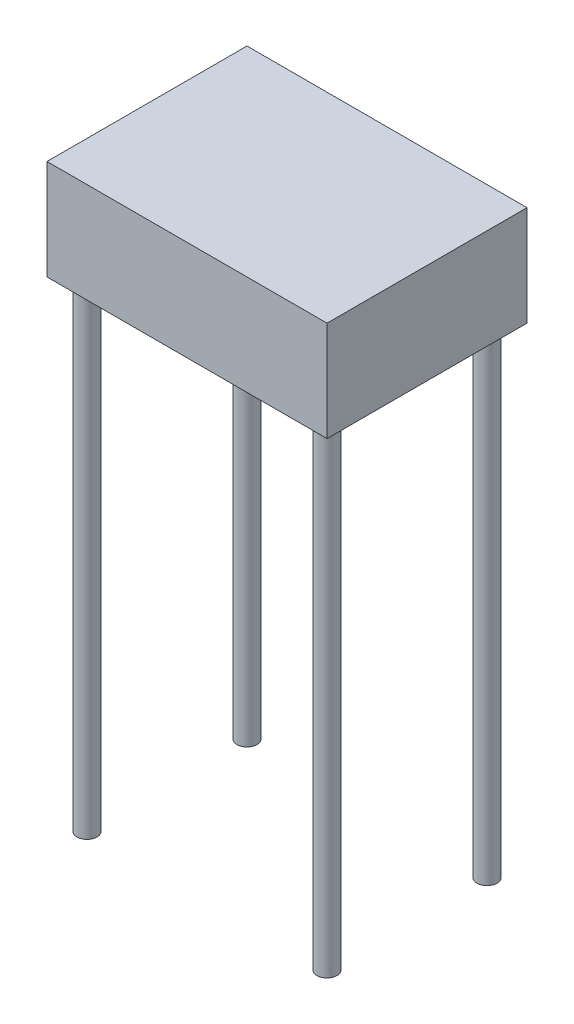
ISO-10303-21;
HEADER;
FILE_DESCRIPTION(('STEP AP214'),'2;1');
FILE_NAME('part.step','',(''),(''),'','','');
FILE_SCHEMA(('AUTOMOTIVE_DESIGN { 1 0 10303 214 1 1 1 1 }'));
ENDSEC;
DATA;
#1=APPLICATION_CONTEXT('core data for automotive mechanical design processes');
#2=APPLICATION_PROTOCOL_DEFINITION('international standard','automotive_design',2000,#1);
#3=PRODUCT_CONTEXT('',#1,'mechanical');
#4=PRODUCT('Part','Part','',(#3));
#5=PRODUCT_RELATED_PRODUCT_CATEGORY('part','',(#4));
#6=PRODUCT_DEFINITION_FORMATION('','',#4);
#7=PRODUCT_DEFINITION_CONTEXT('part definition',#1,'design');
#8=PRODUCT_DEFINITION('design','',#6,#7);
#9=PRODUCT_DEFINITION_SHAPE('','',#8);
#10=(LENGTH_UNIT() NAMED_UNIT(*) SI_UNIT(.MILLI.,.METRE.));
#11=(NAMED_UNIT(*) PLANE_ANGLE_UNIT() SI_UNIT($,.RADIAN.));
#12=(NAMED_UNIT(*) SI_UNIT($,.STERADIAN.) SOLID_ANGLE_UNIT());
#13=UNCERTAINTY_MEASURE_WITH_UNIT(LENGTH_MEASURE(1.E-05),#10,'distance_accuracy_value','');
#14=(GEOMETRIC_REPRESENTATION_CONTEXT(3) GLOBAL_UNCERTAINTY_ASSIGNED_CONTEXT((#13)) GLOBAL_UNIT_ASSIGNED_CONTEXT((#10,
#11,#12)) REPRESENTATION_CONTEXT('',''));
#15=CARTESIAN_POINT('',(0.,0.,0.));
#16=DIRECTION('',(0.,0.,1.));
#17=DIRECTION('',(1.,0.,0.));
#18=AXIS2_PLACEMENT_3D('',#15,#16,#17);
#19=CARTESIAN_POINT('',(-300.,1200.,-200.));
#20=DIRECTION('',(0.,-1.,0.));
#21=DIRECTION('',(0.,0.,-1.));
#22=AXIS2_PLACEMENT_3D('',#19,#20,#21);
#23=CYLINDRICAL_SURFACE('',#22,25.);
#24=CARTESIAN_POINT('',(-300.,1200.,-200.));
#25=DIRECTION('',(0.,1.,0.));
#26=DIRECTION('',(0.,0.,1.));
#27=AXIS2_PLACEMENT_3D('',#24,#25,#26);
#28=CIRCLE('',#27,25.);
#29=CARTESIAN_POINT('',(-300.,1200.,-175.));
#30=VERTEX_POINT('',#29);
#31=EDGE_CURVE('E113',#30,#30,#28,.T.);
#32=ORIENTED_EDGE('',*,*,#31,.F.);
#33=EDGE_LOOP('',(#32));
#34=FACE_BOUND('',#33,.T.);
#35=CARTESIAN_POINT('',(-300.,0.,-200.));
#36=DIRECTION('',(0.,1.,0.));
#37=DIRECTION('',(0.,0.,1.));
#38=AXIS2_PLACEMENT_3D('',#35,#36,#37);
#39=CIRCLE('',#38,25.);
#40=CARTESIAN_POINT('',(-300.,0.,-175.));
#41=VERTEX_POINT('',#40);
#42=EDGE_CURVE('E112',#41,#41,#39,.T.);
#43=ORIENTED_EDGE('',*,*,#42,.T.);
#44=EDGE_LOOP('',(#43));
#45=FACE_BOUND('',#44,.T.);
#46=ADVANCED_FACE('F35',(#34,#45),#23,.T.);
#47=CARTESIAN_POINT('',(-300.,0.,-200.));
#48=DIRECTION('',(0.,1.,0.));
#49=DIRECTION('',(0.,0.,1.));
#50=AXIS2_PLACEMENT_3D('',#47,#48,#49);
#51=PLANE('',#50);
#52=ORIENTED_EDGE('',*,*,#42,.F.);
#53=EDGE_LOOP('',(#52));
#54=FACE_BOUND('',#53,.T.);
#55=ADVANCED_FACE('F149',(#54),#51,.F.);
#56=CARTESIAN_POINT('',(350.,1450.,-250.));
#57=DIRECTION('',(-1.,0.,0.));
#58=DIRECTION('',(0.,0.,1.));
#59=AXIS2_PLACEMENT_3D('',#56,#57,#58);
#60=PLANE('',#59);
#61=DIRECTION('',(0.,0.,-1.));
#62=VECTOR('',#61,1.);
#63=CARTESIAN_POINT('',(350.,1200.,-250.));
#64=LINE('',#63,#62);
#65=CARTESIAN_POINT('',(350.,1200.,250.));
#66=VERTEX_POINT('',#65);
#67=CARTESIAN_POINT('',(350.,1200.,-250.));
#68=VERTEX_POINT('',#67);
#69=EDGE_CURVE('E102',#66,#68,#64,.T.);
#70=ORIENTED_EDGE('',*,*,#69,.T.);
#71=DIRECTION('',(0.,-1.,0.));
#72=VECTOR('',#71,1.);
#73=CARTESIAN_POINT('',(350.,1450.,-250.));
#74=LINE('',#73,#72);
#75=CARTESIAN_POINT('',(350.,1450.,-250.));
#76=VERTEX_POINT('',#75);
#77=EDGE_CURVE('E93',#76,#68,#74,.T.);
#78=ORIENTED_EDGE('',*,*,#77,.F.);
#79=DIRECTION('',(0.,0.,-1.));
#80=VECTOR('',#79,1.);
#81=CARTESIAN_POINT('',(350.,1450.,-250.));
#82=LINE('',#81,#80);
#83=CARTESIAN_POINT('',(350.,1450.,250.));
#84=VERTEX_POINT('',#83);
#85=EDGE_CURVE('E87',#84,#76,#82,.T.);
#86=ORIENTED_EDGE('',*,*,#85,.F.);
#87=DIRECTION('',(0.,-1.,0.));
#88=VECTOR('',#87,1.);
#89=CARTESIAN_POINT('',(350.,1450.,250.));
#90=LINE('',#89,#88);
#91=EDGE_CURVE('E98',#84,#66,#90,.T.);
#92=ORIENTED_EDGE('',*,*,#91,.T.);
#93=EDGE_LOOP('',(#70,#78,#86,#92));
#94=FACE_BOUND('',#93,.T.);
#95=ADVANCED_FACE('F138',(#94),#60,.F.);
#96=CARTESIAN_POINT('',(-350.,1450.,-250.));
#97=DIRECTION('',(0.,0.,1.));
#98=DIRECTION('',(1.,0.,0.));
#99=AXIS2_PLACEMENT_3D('',#96,#97,#98);
#100=PLANE('',#99);
#101=DIRECTION('',(-1.,0.,0.));
#102=VECTOR('',#101,1.);
#103=CARTESIAN_POINT('',(-350.,1200.,-250.));
#104=LINE('',#103,#102);
#105=CARTESIAN_POINT('',(-350.,1200.,-250.));
#106=VERTEX_POINT('',#105);
#107=EDGE_CURVE('E92',#68,#106,#104,.T.);
#108=ORIENTED_EDGE('',*,*,#107,.T.);
#109=DIRECTION('',(0.,-1.,0.));
#110=VECTOR('',#109,1.);
#111=CARTESIAN_POINT('',(-350.,1450.,-250.));
#112=LINE('',#111,#110);
#113=CARTESIAN_POINT('',(-350.,1450.,-250.));
#114=VERTEX_POINT('',#113);
#115=EDGE_CURVE('E90',#114,#106,#112,.T.);
#116=ORIENTED_EDGE('',*,*,#115,.F.);
#117=DIRECTION('',(-1.,0.,0.));
#118=VECTOR('',#117,1.);
#119=CARTESIAN_POINT('',(-350.,1450.,-250.));
#120=LINE('',#119,#118);
#121=EDGE_CURVE('E82',#76,#114,#120,.T.);
#122=ORIENTED_EDGE('',*,*,#121,.F.);
#123=ORIENTED_EDGE('',*,*,#77,.T.);
#124=EDGE_LOOP('',(#108,#116,#122,#123));
#125=FACE_BOUND('',#124,.T.);
#126=ADVANCED_FACE('F91',(#125),#100,.F.);
#127=CARTESIAN_POINT('',(-350.,1450.,-250.));
#128=DIRECTION('',(1.,0.,0.));
#129=DIRECTION('',(0.,0.,-1.));
#130=AXIS2_PLACEMENT_3D('',#127,#128,#129);
#131=PLANE('',#130);
#132=DIRECTION('',(0.,0.,1.));
#133=VECTOR('',#132,1.);
#134=CARTESIAN_POINT('',(-350.,1200.,-250.));
#135=LINE('',#134,#133);
#136=CARTESIAN_POINT('',(-350.,1200.,250.));
#137=VERTEX_POINT('',#136);
#138=EDGE_CURVE('E68',#106,#137,#135,.T.);
#139=ORIENTED_EDGE('',*,*,#138,.T.);
#140=DIRECTION('',(0.,-1.,0.));
#141=VECTOR('',#140,1.);
#142=CARTESIAN_POINT('',(-350.,1450.,250.));
#143=LINE('',#142,#141);
#144=CARTESIAN_POINT('',(-350.,1450.,250.));
#145=VERTEX_POINT('',#144);
#146=EDGE_CURVE('E94',#145,#137,#143,.T.);
#147=ORIENTED_EDGE('',*,*,#146,.F.);
#148=DIRECTION('',(0.,0.,1.));
#149=VECTOR('',#148,1.);
#150=CARTESIAN_POINT('',(-350.,1450.,-250.));
#151=LINE('',#150,#149);
#152=EDGE_CURVE('E85',#114,#145,#151,.T.);
#153=ORIENTED_EDGE('',*,*,#152,.F.);
#154=ORIENTED_EDGE('',*,*,#115,.T.);
#155=EDGE_LOOP('',(#139,#147,#153,#154));
#156=FACE_BOUND('',#155,.T.);
#157=ADVANCED_FACE('F96',(#156),#131,.F.);
#158=CARTESIAN_POINT('',(-350.,1450.,250.));
#159=DIRECTION('',(0.,0.,-1.));
#160=DIRECTION('',(-1.,0.,0.));
#161=AXIS2_PLACEMENT_3D('',#158,#159,#160);
#162=PLANE('',#161);
#163=DIRECTION('',(1.,0.,0.));
#164=VECTOR('',#163,1.);
#165=CARTESIAN_POINT('',(-350.,1200.,250.));
#166=LINE('',#165,#164);
#167=EDGE_CURVE('E74',#137,#66,#166,.T.);
#168=ORIENTED_EDGE('',*,*,#167,.T.);
#169=ORIENTED_EDGE('',*,*,#91,.F.);
#170=DIRECTION('',(1.,0.,0.));
#171=VECTOR('',#170,1.);
#172=CARTESIAN_POINT('',(-350.,1450.,250.));
#173=LINE('',#172,#171);
#174=EDGE_CURVE('E51',#145,#84,#173,.T.);
#175=ORIENTED_EDGE('',*,*,#174,.F.);
#176=ORIENTED_EDGE('',*,*,#146,.T.);
#177=EDGE_LOOP('',(#168,#169,#175,#176));
#178=FACE_BOUND('',#177,.T.);
#179=ADVANCED_FACE('F139',(#178),#162,.F.);
#180=CARTESIAN_POINT('',(0.,1450.,0.));
#181=DIRECTION('',(0.,1.,0.));
#182=DIRECTION('',(0.,0.,1.));
#183=AXIS2_PLACEMENT_3D('',#180,#181,#182);
#184=PLANE('',#183);
#185=ORIENTED_EDGE('',*,*,#85,.T.);
#186=ORIENTED_EDGE('',*,*,#121,.T.);
#187=ORIENTED_EDGE('',*,*,#152,.T.);
#188=ORIENTED_EDGE('',*,*,#174,.T.);
#189=EDGE_LOOP('',(#185,#186,#187,#188));
#190=FACE_BOUND('',#189,.T.);
#191=ADVANCED_FACE('F83',(#190),#184,.T.);
#192=CARTESIAN_POINT('',(0.,1200.,0.));
#193=DIRECTION('',(0.,1.,0.));
#194=DIRECTION('',(0.,0.,1.));
#195=AXIS2_PLACEMENT_3D('',#192,#193,#194);
#196=PLANE('',#195);
#197=CARTESIAN_POINT('',(-300.,1200.,200.));
#198=DIRECTION('',(0.,1.,0.));
#199=DIRECTION('',(0.,0.,1.));
#200=AXIS2_PLACEMENT_3D('',#197,#198,#199);
#201=CIRCLE('',#200,25.);
#202=CARTESIAN_POINT('',(-300.,1200.,225.));
#203=VERTEX_POINT('',#202);
#204=EDGE_CURVE('E11',#203,#203,#201,.F.);
#205=ORIENTED_EDGE('',*,*,#204,.F.);
#206=EDGE_LOOP('',(#205));
#207=FACE_BOUND('',#206,.T.);
#208=CARTESIAN_POINT('',(300.,1200.,200.));
#209=DIRECTION('',(0.,1.,0.));
#210=DIRECTION('',(0.,0.,1.));
#211=AXIS2_PLACEMENT_3D('',#208,#209,#210);
#212=CIRCLE('',#211,25.);
#213=CARTESIAN_POINT('',(300.,1200.,225.));
#214=VERTEX_POINT('',#213);
#215=EDGE_CURVE('E43',#214,#214,#212,.F.);
#216=ORIENTED_EDGE('',*,*,#215,.F.);
#217=EDGE_LOOP('',(#216));
#218=FACE_BOUND('',#217,.T.);
#219=CARTESIAN_POINT('',(300.,1200.,-200.));
#220=DIRECTION('',(0.,1.,0.));
#221=DIRECTION('',(0.,0.,1.));
#222=AXIS2_PLACEMENT_3D('',#219,#220,#221);
#223=CIRCLE('',#222,25.);
#224=CARTESIAN_POINT('',(300.,1200.,-175.));
#225=VERTEX_POINT('',#224);
#226=EDGE_CURVE('E116',#225,#225,#223,.F.);
#227=ORIENTED_EDGE('',*,*,#226,.F.);
#228=EDGE_LOOP('',(#227));
#229=FACE_BOUND('',#228,.T.);
#230=ORIENTED_EDGE('',*,*,#31,.T.);
#231=EDGE_LOOP('',(#230));
#232=FACE_BOUND('',#231,.T.);
#233=ORIENTED_EDGE('',*,*,#69,.F.);
#234=ORIENTED_EDGE('',*,*,#167,.F.);
#235=ORIENTED_EDGE('',*,*,#138,.F.);
#236=ORIENTED_EDGE('',*,*,#107,.F.);
#237=EDGE_LOOP('',(#233,#234,#235,#236));
#238=FACE_BOUND('',#237,.T.);
#239=ADVANCED_FACE('F126',(#207,#218,#229,#232,#238),#196,.F.);
#240=CARTESIAN_POINT('',(300.,1200.,-200.));
#241=DIRECTION('',(0.,-1.,0.));
#242=DIRECTION('',(0.,0.,-1.));
#243=AXIS2_PLACEMENT_3D('',#240,#241,#242);
#244=CYLINDRICAL_SURFACE('',#243,25.);
#245=ORIENTED_EDGE('',*,*,#226,.T.);
#246=EDGE_LOOP('',(#245));
#247=FACE_BOUND('',#246,.T.);
#248=CARTESIAN_POINT('',(300.,0.,-200.));
#249=DIRECTION('',(0.,1.,0.));
#250=DIRECTION('',(0.,0.,1.));
#251=AXIS2_PLACEMENT_3D('',#248,#249,#250);
#252=CIRCLE('',#251,25.);
#253=CARTESIAN_POINT('',(300.,0.,-175.));
#254=VERTEX_POINT('',#253);
#255=EDGE_CURVE('E105',#254,#254,#252,.T.);
#256=ORIENTED_EDGE('',*,*,#255,.T.);
#257=EDGE_LOOP('',(#256));
#258=FACE_BOUND('',#257,.T.);
#259=ADVANCED_FACE('F129',(#247,#258),#244,.T.);
#260=CARTESIAN_POINT('',(300.,0.,-200.));
#261=DIRECTION('',(0.,1.,0.));
#262=DIRECTION('',(0.,0.,1.));
#263=AXIS2_PLACEMENT_3D('',#260,#261,#262);
#264=PLANE('',#263);
#265=ORIENTED_EDGE('',*,*,#255,.F.);
#266=EDGE_LOOP('',(#265));
#267=FACE_BOUND('',#266,.T.);
#268=ADVANCED_FACE('F196',(#267),#264,.F.);
#269=CARTESIAN_POINT('',(300.,1200.,200.));
#270=DIRECTION('',(0.,-1.,0.));
#271=DIRECTION('',(0.,0.,-1.));
#272=AXIS2_PLACEMENT_3D('',#269,#270,#271);
#273=CYLINDRICAL_SURFACE('',#272,25.);
#274=ORIENTED_EDGE('',*,*,#215,.T.);
#275=EDGE_LOOP('',(#274));
#276=FACE_BOUND('',#275,.T.);
#277=CARTESIAN_POINT('',(300.,0.,200.));
#278=DIRECTION('',(0.,1.,0.));
#279=DIRECTION('',(0.,0.,1.));
#280=AXIS2_PLACEMENT_3D('',#277,#278,#279);
#281=CIRCLE('',#280,25.);
#282=CARTESIAN_POINT('',(300.,0.,225.));
#283=VERTEX_POINT('',#282);
#284=EDGE_CURVE('E266',#283,#283,#281,.T.);
#285=ORIENTED_EDGE('',*,*,#284,.T.);
#286=EDGE_LOOP('',(#285));
#287=FACE_BOUND('',#286,.T.);
#288=ADVANCED_FACE('F123',(#276,#287),#273,.T.);
#289=CARTESIAN_POINT('',(300.,0.,200.));
#290=DIRECTION('',(0.,1.,0.));
#291=DIRECTION('',(0.,0.,1.));
#292=AXIS2_PLACEMENT_3D('',#289,#290,#291);
#293=PLANE('',#292);
#294=ORIENTED_EDGE('',*,*,#284,.F.);
#295=EDGE_LOOP('',(#294));
#296=FACE_BOUND('',#295,.T.);
#297=ADVANCED_FACE('F216',(#296),#293,.F.);
#298=CARTESIAN_POINT('',(-300.,1200.,200.));
#299=DIRECTION('',(0.,-1.,0.));
#300=DIRECTION('',(0.,0.,-1.));
#301=AXIS2_PLACEMENT_3D('',#298,#299,#300);
#302=CYLINDRICAL_SURFACE('',#301,25.);
#303=ORIENTED_EDGE('',*,*,#204,.T.);
#304=EDGE_LOOP('',(#303));
#305=FACE_BOUND('',#304,.T.);
#306=CARTESIAN_POINT('',(-300.,0.,200.));
#307=DIRECTION('',(0.,1.,0.));
#308=DIRECTION('',(0.,0.,1.));
#309=AXIS2_PLACEMENT_3D('',#306,#307,#308);
#310=CIRCLE('',#309,25.);
#311=CARTESIAN_POINT('',(-300.,0.,225.));
#312=VERTEX_POINT('',#311);
#313=EDGE_CURVE('E264',#312,#312,#310,.T.);
#314=ORIENTED_EDGE('',*,*,#313,.T.);
#315=EDGE_LOOP('',(#314));
#316=FACE_BOUND('',#315,.T.);
#317=ADVANCED_FACE('F225',(#305,#316),#302,.T.);
#318=CARTESIAN_POINT('',(-300.,0.,200.));
#319=DIRECTION('',(0.,1.,0.));
#320=DIRECTION('',(0.,0.,1.));
#321=AXIS2_PLACEMENT_3D('',#318,#319,#320);
#322=PLANE('',#321);
#323=ORIENTED_EDGE('',*,*,#313,.F.);
#324=EDGE_LOOP('',(#323));
#325=FACE_BOUND('',#324,.T.);
#326=ADVANCED_FACE('F235',(#325),#322,.F.);
#327=CLOSED_SHELL('',(#46,#55,#95,#126,#157,#179,#191,#239,#259,#268,#288,#297,#317,#326));
#328=MANIFOLD_SOLID_BREP('B2',#327);
#329=ADVANCED_BREP_SHAPE_REPRESENTATION('',(#18,#328),#14);
#330=SHAPE_DEFINITION_REPRESENTATION(#9,#329);
ENDSEC;
END-ISO-10303-21;
